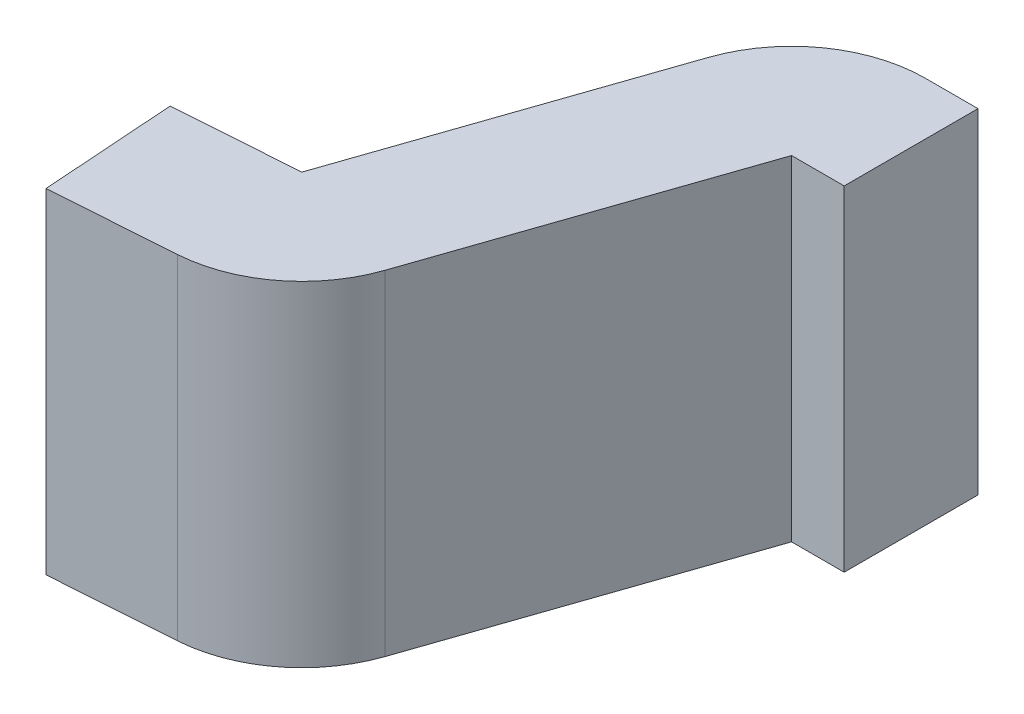
ISO-10303-21;
HEADER;
FILE_DESCRIPTION(('STEP AP214'),'2;1');
FILE_NAME('part.step','',(''),(''),'','','');
FILE_SCHEMA(('AUTOMOTIVE_DESIGN { 1 0 10303 214 1 1 1 1 }'));
ENDSEC;
DATA;
#1=APPLICATION_CONTEXT('core data for automotive mechanical design processes');
#2=APPLICATION_PROTOCOL_DEFINITION('international standard','automotive_design',2000,#1);
#3=PRODUCT_CONTEXT('',#1,'mechanical');
#4=PRODUCT('Part','Part','',(#3));
#5=PRODUCT_RELATED_PRODUCT_CATEGORY('part','',(#4));
#6=PRODUCT_DEFINITION_FORMATION('','',#4);
#7=PRODUCT_DEFINITION_CONTEXT('part definition',#1,'design');
#8=PRODUCT_DEFINITION('design','',#6,#7);
#9=PRODUCT_DEFINITION_SHAPE('','',#8);
#10=(LENGTH_UNIT() NAMED_UNIT(*) SI_UNIT(.MILLI.,.METRE.));
#11=(NAMED_UNIT(*) PLANE_ANGLE_UNIT() SI_UNIT($,.RADIAN.));
#12=(NAMED_UNIT(*) SI_UNIT($,.STERADIAN.) SOLID_ANGLE_UNIT());
#13=UNCERTAINTY_MEASURE_WITH_UNIT(LENGTH_MEASURE(1.E-05),#10,'distance_accuracy_value','');
#14=(GEOMETRIC_REPRESENTATION_CONTEXT(3) GLOBAL_UNCERTAINTY_ASSIGNED_CONTEXT((#13)) GLOBAL_UNIT_ASSIGNED_CONTEXT((#10,
#11,#12)) REPRESENTATION_CONTEXT('',''));
#15=CARTESIAN_POINT('',(0.,0.,0.));
#16=DIRECTION('',(0.,0.,1.));
#17=DIRECTION('',(1.,0.,0.));
#18=AXIS2_PLACEMENT_3D('',#15,#16,#17);
#19=CARTESIAN_POINT('',(0.00697564737441257,0.25,0.0997564050259824));
#20=DIRECTION('',(0.997564050259824,0.,-0.0697564737441257));
#21=DIRECTION('',(-0.0697564737441257,0.,-0.997564050259824));
#22=AXIS2_PLACEMENT_3D('',#19,#20,#21);
#23=PLANE('',#22);
#24=DIRECTION('',(0.0697564737441256,0.,0.997564050259824));
#25=VECTOR('',#24,1.);
#26=CARTESIAN_POINT('',(0.00697564737441257,-0.25,0.0997564050259824));
#27=LINE('',#26,#25);
#28=CARTESIAN_POINT('',(-0.00697564737441257,-0.25,-0.0997564050259824));
#29=VERTEX_POINT('',#28);
#30=CARTESIAN_POINT('',(0.00697564737441257,-0.25,0.0997564050259824));
#31=VERTEX_POINT('',#30);
#32=EDGE_CURVE('E152',#29,#31,#27,.T.);
#33=ORIENTED_EDGE('',*,*,#32,.T.);
#34=DIRECTION('',(0.,-1.,0.));
#35=VECTOR('',#34,1.);
#36=CARTESIAN_POINT('',(0.00697564737441257,0.25,0.0997564050259824));
#37=LINE('',#36,#35);
#38=CARTESIAN_POINT('',(0.00697564737441257,0.25,0.0997564050259824));
#39=VERTEX_POINT('',#38);
#40=EDGE_CURVE('E11',#39,#31,#37,.T.);
#41=ORIENTED_EDGE('',*,*,#40,.F.);
#42=DIRECTION('',(0.0697564737441256,0.,0.997564050259824));
#43=VECTOR('',#42,1.);
#44=CARTESIAN_POINT('',(0.00697564737441257,0.25,0.0997564050259824));
#45=LINE('',#44,#43);
#46=CARTESIAN_POINT('',(-0.00697564737441257,0.25,-0.0997564050259824));
#47=VERTEX_POINT('',#46);
#48=EDGE_CURVE('E180',#47,#39,#45,.T.);
#49=ORIENTED_EDGE('',*,*,#48,.F.);
#50=DIRECTION('',(0.,-1.,0.));
#51=VECTOR('',#50,1.);
#52=CARTESIAN_POINT('',(-0.00697564737441257,0.25,-0.0997564050259824));
#53=LINE('',#52,#51);
#54=EDGE_CURVE('E148',#47,#29,#53,.T.);
#55=ORIENTED_EDGE('',*,*,#54,.T.);
#56=EDGE_LOOP('',(#33,#41,#49,#55));
#57=FACE_BOUND('',#56,.T.);
#58=ADVANCED_FACE('F39',(#57),#23,.F.);
#59=CARTESIAN_POINT('',(0.00697564737441257,0.25,0.0997564050259824));
#60=DIRECTION('',(-0.0697564737441257,0.,-0.997564050259824));
#61=DIRECTION('',(-0.997564050259824,0.,0.0697564737441257));
#62=AXIS2_PLACEMENT_3D('',#59,#60,#61);
#63=PLANE('',#62);
#64=DIRECTION('',(0.997564050259824,0.,-0.0697564737441256));
#65=VECTOR('',#64,1.);
#66=CARTESIAN_POINT('',(0.00697564737441257,-0.25,0.0997564050259824));
#67=LINE('',#66,#65);
#68=CARTESIAN_POINT('',(0.190884751339631,-0.25,0.086896227698307));
#69=VERTEX_POINT('',#68);
#70=EDGE_CURVE('E156',#31,#69,#67,.T.);
#71=ORIENTED_EDGE('',*,*,#70,.T.);
#72=DIRECTION('',(0.,-1.,0.));
#73=VECTOR('',#72,1.);
#74=CARTESIAN_POINT('',(0.190884751339631,0.25,0.086896227698307));
#75=LINE('',#74,#73);
#76=CARTESIAN_POINT('',(0.190884751339631,0.25,0.086896227698307));
#77=VERTEX_POINT('',#76);
#78=EDGE_CURVE('E48',#77,#69,#75,.T.);
#79=ORIENTED_EDGE('',*,*,#78,.F.);
#80=DIRECTION('',(0.997564050259824,0.,-0.0697564737441256));
#81=VECTOR('',#80,1.);
#82=CARTESIAN_POINT('',(0.00697564737441257,0.25,0.0997564050259824));
#83=LINE('',#82,#81);
#84=EDGE_CURVE('E105',#39,#77,#83,.T.);
#85=ORIENTED_EDGE('',*,*,#84,.F.);
#86=ORIENTED_EDGE('',*,*,#40,.T.);
#87=EDGE_LOOP('',(#71,#79,#85,#86));
#88=FACE_BOUND('',#87,.T.);
#89=ADVANCED_FACE('F244',(#88),#63,.F.);
#90=CARTESIAN_POINT('',(0.176933456590807,0.25,-0.112616582353658));
#91=DIRECTION('',(0.,-1.,0.));
#92=DIRECTION('',(0.,0.,-1.));
#93=AXIS2_PLACEMENT_3D('',#90,#91,#92);
#94=CYLINDRICAL_SURFACE('',#93,0.2);
#95=CARTESIAN_POINT('',(0.176933456590807,-0.25,-0.112616582353658));
#96=DIRECTION('',(0.,1.,0.));
#97=DIRECTION('',(0.,0.,1.));
#98=AXIS2_PLACEMENT_3D('',#95,#96,#97);
#99=CIRCLE('',#98,0.2);
#100=CARTESIAN_POINT('',(0.366094789024019,-0.25,-0.0476705254133646));
#101=VERTEX_POINT('',#100);
#102=EDGE_CURVE('E159',#69,#101,#99,.T.);
#103=ORIENTED_EDGE('',*,*,#102,.T.);
#104=DIRECTION('',(0.,-1.,0.));
#105=VECTOR('',#104,1.);
#106=CARTESIAN_POINT('',(0.366094789024019,0.25,-0.0476705254133646));
#107=LINE('',#106,#105);
#108=CARTESIAN_POINT('',(0.366094789024019,0.25,-0.0476705254133646));
#109=VERTEX_POINT('',#108);
#110=EDGE_CURVE('E199',#109,#101,#107,.T.);
#111=ORIENTED_EDGE('',*,*,#110,.F.);
#112=CARTESIAN_POINT('',(0.176933456590807,0.25,-0.112616582353658));
#113=DIRECTION('',(0.,1.,0.));
#114=DIRECTION('',(0.,0.,1.));
#115=AXIS2_PLACEMENT_3D('',#112,#113,#114);
#116=CIRCLE('',#115,0.2);
#117=EDGE_CURVE('E209',#77,#109,#116,.T.);
#118=ORIENTED_EDGE('',*,*,#117,.F.);
#119=ORIENTED_EDGE('',*,*,#78,.T.);
#120=EDGE_LOOP('',(#103,#111,#118,#119));
#121=FACE_BOUND('',#120,.T.);
#122=ADVANCED_FACE('F207',(#121),#94,.T.);
#123=CARTESIAN_POINT('',(0.366094789024019,0.25,-0.0476705254133646));
#124=DIRECTION('',(-0.945806662166059,0.,-0.324730284701471));
#125=DIRECTION('',(-0.324730284701471,0.,0.945806662166059));
#126=AXIS2_PLACEMENT_3D('',#123,#124,#125);
#127=PLANE('',#126);
#128=DIRECTION('',(0.324730284701471,0.,-0.945806662166059));
#129=VECTOR('',#128,1.);
#130=CARTESIAN_POINT('',(0.366094789024019,-0.25,-0.0476705254133646));
#131=LINE('',#130,#129);
#132=CARTESIAN_POINT('',(0.521396168192773,-0.25,-0.499999999999999));
#133=VERTEX_POINT('',#132);
#134=EDGE_CURVE('E162',#101,#133,#131,.T.);
#135=ORIENTED_EDGE('',*,*,#134,.T.);
#136=DIRECTION('',(0.,-1.,0.));
#137=VECTOR('',#136,1.);
#138=CARTESIAN_POINT('',(0.521396168192773,0.25,-0.499999999999999));
#139=LINE('',#138,#137);
#140=CARTESIAN_POINT('',(0.521396168192773,0.25,-0.499999999999999));
#141=VERTEX_POINT('',#140);
#142=EDGE_CURVE('E195',#141,#133,#139,.T.);
#143=ORIENTED_EDGE('',*,*,#142,.F.);
#144=DIRECTION('',(0.324730284701471,0.,-0.945806662166059));
#145=VECTOR('',#144,1.);
#146=CARTESIAN_POINT('',(0.366094789024019,0.25,-0.0476705254133646));
#147=LINE('',#146,#145);
#148=EDGE_CURVE('E228',#109,#141,#147,.T.);
#149=ORIENTED_EDGE('',*,*,#148,.F.);
#150=ORIENTED_EDGE('',*,*,#110,.T.);
#151=EDGE_LOOP('',(#135,#143,#149,#150));
#152=FACE_BOUND('',#151,.T.);
#153=ADVANCED_FACE('F218',(#152),#127,.F.);
#154=CARTESIAN_POINT('',(0.521396168192773,0.25,-0.499999999999999));
#155=DIRECTION('',(0.,0.,-1.));
#156=DIRECTION('',(-1.,0.,0.));
#157=AXIS2_PLACEMENT_3D('',#154,#155,#156);
#158=PLANE('',#157);
#159=DIRECTION('',(1.,0.,0.));
#160=VECTOR('',#159,1.);
#161=CARTESIAN_POINT('',(0.521396168192773,-0.25,-0.499999999999999));
#162=LINE('',#161,#160);
#163=CARTESIAN_POINT('',(0.6,-0.25,-0.5));
#164=VERTEX_POINT('',#163);
#165=EDGE_CURVE('E165',#133,#164,#162,.T.);
#166=ORIENTED_EDGE('',*,*,#165,.T.);
#167=DIRECTION('',(0.,-1.,0.));
#168=VECTOR('',#167,1.);
#169=CARTESIAN_POINT('',(0.6,0.25,-0.5));
#170=LINE('',#169,#168);
#171=CARTESIAN_POINT('',(0.6,0.25,-0.5));
#172=VERTEX_POINT('',#171);
#173=EDGE_CURVE('E191',#172,#164,#170,.T.);
#174=ORIENTED_EDGE('',*,*,#173,.F.);
#175=DIRECTION('',(1.,0.,0.));
#176=VECTOR('',#175,1.);
#177=CARTESIAN_POINT('',(0.521396168192773,0.25,-0.499999999999999));
#178=LINE('',#177,#176);
#179=EDGE_CURVE('E224',#141,#172,#178,.T.);
#180=ORIENTED_EDGE('',*,*,#179,.F.);
#181=ORIENTED_EDGE('',*,*,#142,.T.);
#182=EDGE_LOOP('',(#166,#174,#180,#181));
#183=FACE_BOUND('',#182,.T.);
#184=ADVANCED_FACE('F222',(#183),#158,.F.);
#185=CARTESIAN_POINT('',(0.6,0.25,-0.5));
#186=DIRECTION('',(-1.,0.,0.));
#187=DIRECTION('',(0.,0.,1.));
#188=AXIS2_PLACEMENT_3D('',#185,#186,#187);
#189=PLANE('',#188);
#190=DIRECTION('',(0.,0.,-1.));
#191=VECTOR('',#190,1.);
#192=CARTESIAN_POINT('',(0.6,-0.25,-0.5));
#193=LINE('',#192,#191);
#194=CARTESIAN_POINT('',(0.6,-0.25,-0.7));
#195=VERTEX_POINT('',#194);
#196=EDGE_CURVE('E168',#164,#195,#193,.T.);
#197=ORIENTED_EDGE('',*,*,#196,.T.);
#198=DIRECTION('',(0.,-1.,0.));
#199=VECTOR('',#198,1.);
#200=CARTESIAN_POINT('',(0.6,0.25,-0.7));
#201=LINE('',#200,#199);
#202=CARTESIAN_POINT('',(0.6,0.25,-0.7));
#203=VERTEX_POINT('',#202);
#204=EDGE_CURVE('E187',#203,#195,#201,.T.);
#205=ORIENTED_EDGE('',*,*,#204,.F.);
#206=DIRECTION('',(0.,0.,-1.));
#207=VECTOR('',#206,1.);
#208=CARTESIAN_POINT('',(0.6,0.25,-0.5));
#209=LINE('',#208,#207);
#210=EDGE_CURVE('E227',#172,#203,#209,.T.);
#211=ORIENTED_EDGE('',*,*,#210,.F.);
#212=ORIENTED_EDGE('',*,*,#173,.T.);
#213=EDGE_LOOP('',(#197,#205,#211,#212));
#214=FACE_BOUND('',#213,.T.);
#215=ADVANCED_FACE('F256',(#214),#189,.F.);
#216=CARTESIAN_POINT('',(0.521396168192774,0.25,-0.7));
#217=DIRECTION('',(0.,0.,1.));
#218=DIRECTION('',(1.,0.,0.));
#219=AXIS2_PLACEMENT_3D('',#216,#217,#218);
#220=PLANE('',#219);
#221=DIRECTION('',(-1.,0.,0.));
#222=VECTOR('',#221,1.);
#223=CARTESIAN_POINT('',(0.521396168192774,-0.25,-0.7));
#224=LINE('',#223,#222);
#225=CARTESIAN_POINT('',(0.521396168192774,-0.25,-0.7));
#226=VERTEX_POINT('',#225);
#227=EDGE_CURVE('E171',#195,#226,#224,.T.);
#228=ORIENTED_EDGE('',*,*,#227,.T.);
#229=DIRECTION('',(0.,-1.,0.));
#230=VECTOR('',#229,1.);
#231=CARTESIAN_POINT('',(0.521396168192774,0.25,-0.7));
#232=LINE('',#231,#230);
#233=CARTESIAN_POINT('',(0.521396168192774,0.25,-0.7));
#234=VERTEX_POINT('',#233);
#235=EDGE_CURVE('E141',#234,#226,#232,.T.);
#236=ORIENTED_EDGE('',*,*,#235,.F.);
#237=DIRECTION('',(-1.,0.,0.));
#238=VECTOR('',#237,1.);
#239=CARTESIAN_POINT('',(0.521396168192774,0.25,-0.7));
#240=LINE('',#239,#238);
#241=EDGE_CURVE('E130',#203,#234,#240,.T.);
#242=ORIENTED_EDGE('',*,*,#241,.F.);
#243=ORIENTED_EDGE('',*,*,#204,.T.);
#244=EDGE_LOOP('',(#228,#236,#242,#243));
#245=FACE_BOUND('',#244,.T.);
#246=ADVANCED_FACE('F259',(#245),#220,.F.);
#247=CARTESIAN_POINT('',(0.521396168192773,0.25,-0.5));
#248=DIRECTION('',(0.,-1.,0.));
#249=DIRECTION('',(0.,0.,-1.));
#250=AXIS2_PLACEMENT_3D('',#247,#248,#249);
#251=CYLINDRICAL_SURFACE('',#250,0.2);
#252=CARTESIAN_POINT('',(0.521396168192773,-0.25,-0.5));
#253=DIRECTION('',(0.,1.,0.));
#254=DIRECTION('',(0.,0.,-1.));
#255=AXIS2_PLACEMENT_3D('',#252,#253,#254);
#256=CIRCLE('',#255,0.2);
#257=CARTESIAN_POINT('',(0.332234835759561,-0.25,-0.564946056940294));
#258=VERTEX_POINT('',#257);
#259=EDGE_CURVE('E139',#226,#258,#256,.T.);
#260=ORIENTED_EDGE('',*,*,#259,.T.);
#261=DIRECTION('',(0.,-1.,0.));
#262=VECTOR('',#261,1.);
#263=CARTESIAN_POINT('',(0.332234835759561,0.25,-0.564946056940294));
#264=LINE('',#263,#262);
#265=CARTESIAN_POINT('',(0.332234835759561,0.25,-0.564946056940294));
#266=VERTEX_POINT('',#265);
#267=EDGE_CURVE('E136',#266,#258,#264,.T.);
#268=ORIENTED_EDGE('',*,*,#267,.F.);
#269=CARTESIAN_POINT('',(0.521396168192773,0.25,-0.5));
#270=DIRECTION('',(0.,1.,0.));
#271=DIRECTION('',(0.,0.,-1.));
#272=AXIS2_PLACEMENT_3D('',#269,#270,#271);
#273=CIRCLE('',#272,0.2);
#274=EDGE_CURVE('E124',#234,#266,#273,.T.);
#275=ORIENTED_EDGE('',*,*,#274,.F.);
#276=ORIENTED_EDGE('',*,*,#235,.T.);
#277=EDGE_LOOP('',(#260,#268,#275,#276));
#278=FACE_BOUND('',#277,.T.);
#279=ADVANCED_FACE('F137',(#278),#251,.T.);
#280=CARTESIAN_POINT('',(0.176933456590806,0.25,-0.112616582353658));
#281=DIRECTION('',(0.945806662166059,0.,0.324730284701472));
#282=DIRECTION('',(0.324730284701472,0.,-0.945806662166059));
#283=AXIS2_PLACEMENT_3D('',#280,#281,#282);
#284=PLANE('',#283);
#285=DIRECTION('',(-0.324730284701472,0.,0.945806662166059));
#286=VECTOR('',#285,1.);
#287=CARTESIAN_POINT('',(0.176933456590806,-0.25,-0.112616582353658));
#288=LINE('',#287,#286);
#289=CARTESIAN_POINT('',(0.176933456590806,-0.25,-0.112616582353658));
#290=VERTEX_POINT('',#289);
#291=EDGE_CURVE('E91',#258,#290,#288,.T.);
#292=ORIENTED_EDGE('',*,*,#291,.T.);
#293=DIRECTION('',(0.,-1.,0.));
#294=VECTOR('',#293,1.);
#295=CARTESIAN_POINT('',(0.176933456590806,0.25,-0.112616582353658));
#296=LINE('',#295,#294);
#297=CARTESIAN_POINT('',(0.176933456590806,0.25,-0.112616582353658));
#298=VERTEX_POINT('',#297);
#299=EDGE_CURVE('E142',#298,#290,#296,.T.);
#300=ORIENTED_EDGE('',*,*,#299,.F.);
#301=DIRECTION('',(-0.324730284701472,0.,0.945806662166059));
#302=VECTOR('',#301,1.);
#303=CARTESIAN_POINT('',(0.176933456590806,0.25,-0.112616582353658));
#304=LINE('',#303,#302);
#305=EDGE_CURVE('E128',#266,#298,#304,.T.);
#306=ORIENTED_EDGE('',*,*,#305,.F.);
#307=ORIENTED_EDGE('',*,*,#267,.T.);
#308=EDGE_LOOP('',(#292,#300,#306,#307));
#309=FACE_BOUND('',#308,.T.);
#310=ADVANCED_FACE('F144',(#309),#284,.F.);
#311=CARTESIAN_POINT('',(-0.00697564737441257,0.25,-0.0997564050259824));
#312=DIRECTION('',(0.0697564737441257,0.,0.997564050259824));
#313=DIRECTION('',(0.997564050259824,0.,-0.0697564737441257));
#314=AXIS2_PLACEMENT_3D('',#311,#312,#313);
#315=PLANE('',#314);
#316=DIRECTION('',(-0.997564050259824,0.,0.0697564737441256));
#317=VECTOR('',#316,1.);
#318=CARTESIAN_POINT('',(-0.00697564737441257,-0.25,-0.0997564050259824));
#319=LINE('',#318,#317);
#320=EDGE_CURVE('E97',#290,#29,#319,.T.);
#321=ORIENTED_EDGE('',*,*,#320,.T.);
#322=ORIENTED_EDGE('',*,*,#54,.F.);
#323=DIRECTION('',(-0.997564050259824,0.,0.0697564737441256));
#324=VECTOR('',#323,1.);
#325=CARTESIAN_POINT('',(-0.00697564737441257,0.25,-0.0997564050259824));
#326=LINE('',#325,#324);
#327=EDGE_CURVE('E56',#298,#47,#326,.T.);
#328=ORIENTED_EDGE('',*,*,#327,.F.);
#329=ORIENTED_EDGE('',*,*,#299,.T.);
#330=EDGE_LOOP('',(#321,#322,#328,#329));
#331=FACE_BOUND('',#330,.T.);
#332=ADVANCED_FACE('F268',(#331),#315,.F.);
#333=CARTESIAN_POINT('',(0.521396168192773,0.25,-0.5));
#334=DIRECTION('',(0.,-1.,0.));
#335=DIRECTION('',(0.,0.,-1.));
#336=AXIS2_PLACEMENT_3D('',#333,#334,#335);
#337=PLANE('',#336);
#338=ORIENTED_EDGE('',*,*,#48,.T.);
#339=ORIENTED_EDGE('',*,*,#84,.T.);
#340=ORIENTED_EDGE('',*,*,#117,.T.);
#341=ORIENTED_EDGE('',*,*,#148,.T.);
#342=ORIENTED_EDGE('',*,*,#179,.T.);
#343=ORIENTED_EDGE('',*,*,#210,.T.);
#344=ORIENTED_EDGE('',*,*,#241,.T.);
#345=ORIENTED_EDGE('',*,*,#274,.T.);
#346=ORIENTED_EDGE('',*,*,#305,.T.);
#347=ORIENTED_EDGE('',*,*,#327,.T.);
#348=EDGE_LOOP('',(#338,#339,#340,#341,#342,#343,#344,#345,#346,#347));
#349=FACE_BOUND('',#348,.T.);
#350=ADVANCED_FACE('F126',(#349),#337,.F.);
#351=CARTESIAN_POINT('',(0.521396168192773,-0.25,-0.5));
#352=DIRECTION('',(0.,-1.,0.));
#353=DIRECTION('',(0.,0.,-1.));
#354=AXIS2_PLACEMENT_3D('',#351,#352,#353);
#355=PLANE('',#354);
#356=ORIENTED_EDGE('',*,*,#32,.F.);
#357=ORIENTED_EDGE('',*,*,#320,.F.);
#358=ORIENTED_EDGE('',*,*,#291,.F.);
#359=ORIENTED_EDGE('',*,*,#259,.F.);
#360=ORIENTED_EDGE('',*,*,#227,.F.);
#361=ORIENTED_EDGE('',*,*,#196,.F.);
#362=ORIENTED_EDGE('',*,*,#165,.F.);
#363=ORIENTED_EDGE('',*,*,#134,.F.);
#364=ORIENTED_EDGE('',*,*,#102,.F.);
#365=ORIENTED_EDGE('',*,*,#70,.F.);
#366=EDGE_LOOP('',(#356,#357,#358,#359,#360,#361,#362,#363,#364,#365));
#367=FACE_BOUND('',#366,.T.);
#368=ADVANCED_FACE('F213',(#367),#355,.T.);
#369=CLOSED_SHELL('',(#58,#89,#122,#153,#184,#215,#246,#279,#310,#332,#350,#368));
#370=MANIFOLD_SOLID_BREP('B2',#369);
#371=ADVANCED_BREP_SHAPE_REPRESENTATION('',(#18,#370),#14);
#372=SHAPE_DEFINITION_REPRESENTATION(#9,#371);
ENDSEC;
END-ISO-10303-21;
